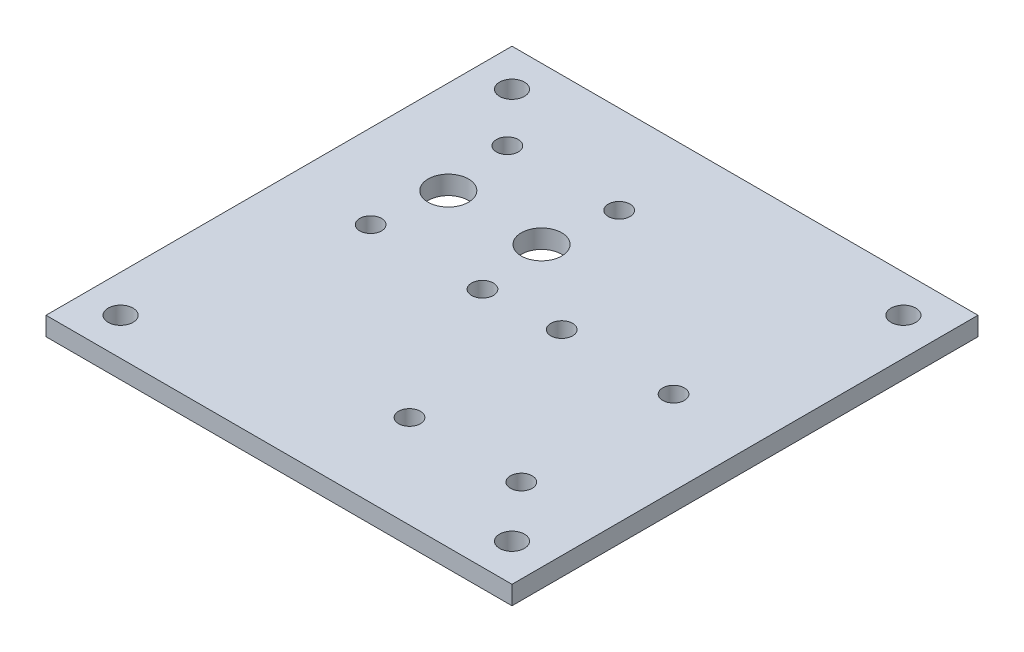
ISO-10303-21;
HEADER;
FILE_DESCRIPTION(('STEP AP214'),'2;1');
FILE_NAME('part.step','',(''),(''),'','','');
FILE_SCHEMA(('AUTOMOTIVE_DESIGN { 1 0 10303 214 1 1 1 1 }'));
ENDSEC;
DATA;
#1=APPLICATION_CONTEXT('core data for automotive mechanical design processes');
#2=APPLICATION_PROTOCOL_DEFINITION('international standard','automotive_design',2000,#1);
#3=PRODUCT_CONTEXT('',#1,'mechanical');
#4=PRODUCT('Part','Part','',(#3));
#5=PRODUCT_RELATED_PRODUCT_CATEGORY('part','',(#4));
#6=PRODUCT_DEFINITION_FORMATION('','',#4);
#7=PRODUCT_DEFINITION_CONTEXT('part definition',#1,'design');
#8=PRODUCT_DEFINITION('design','',#6,#7);
#9=PRODUCT_DEFINITION_SHAPE('','',#8);
#10=(LENGTH_UNIT() NAMED_UNIT(*) SI_UNIT(.MILLI.,.METRE.));
#11=(NAMED_UNIT(*) PLANE_ANGLE_UNIT() SI_UNIT($,.RADIAN.));
#12=(NAMED_UNIT(*) SI_UNIT($,.STERADIAN.) SOLID_ANGLE_UNIT());
#13=UNCERTAINTY_MEASURE_WITH_UNIT(LENGTH_MEASURE(1.E-05),#10,'distance_accuracy_value','');
#14=(GEOMETRIC_REPRESENTATION_CONTEXT(3) GLOBAL_UNCERTAINTY_ASSIGNED_CONTEXT((#13)) GLOBAL_UNIT_ASSIGNED_CONTEXT((#10,
#11,#12)) REPRESENTATION_CONTEXT('',''));
#15=CARTESIAN_POINT('',(0.,0.,0.));
#16=DIRECTION('',(0.,0.,1.));
#17=DIRECTION('',(1.,0.,0.));
#18=AXIS2_PLACEMENT_3D('',#15,#16,#17);
#19=CARTESIAN_POINT('',(0.,3.,0.));
#20=DIRECTION('',(0.,-1.,0.));
#21=DIRECTION('',(0.,0.,-1.));
#22=AXIS2_PLACEMENT_3D('',#19,#20,#21);
#23=PLANE('',#22);
#24=DIRECTION('',(0.,0.,-1.));
#25=VECTOR('',#24,1.);
#26=CARTESIAN_POINT('',(37.5,3.,37.5));
#27=LINE('',#26,#25);
#28=CARTESIAN_POINT('',(37.5,3.,37.5));
#29=VERTEX_POINT('',#28);
#30=CARTESIAN_POINT('',(37.5,3.,-37.5));
#31=VERTEX_POINT('',#30);
#32=EDGE_CURVE('E85',#29,#31,#27,.T.);
#33=ORIENTED_EDGE('',*,*,#32,.T.);
#34=DIRECTION('',(-1.,0.,0.));
#35=VECTOR('',#34,1.);
#36=CARTESIAN_POINT('',(-37.5,3.,-37.5));
#37=LINE('',#36,#35);
#38=CARTESIAN_POINT('',(-37.5,3.,-37.5));
#39=VERTEX_POINT('',#38);
#40=EDGE_CURVE('E80',#31,#39,#37,.T.);
#41=ORIENTED_EDGE('',*,*,#40,.T.);
#42=DIRECTION('',(0.,0.,1.));
#43=VECTOR('',#42,1.);
#44=CARTESIAN_POINT('',(-37.5,3.,37.5));
#45=LINE('',#44,#43);
#46=CARTESIAN_POINT('',(-37.5,3.,37.5));
#47=VERTEX_POINT('',#46);
#48=EDGE_CURVE('E83',#39,#47,#45,.T.);
#49=ORIENTED_EDGE('',*,*,#48,.T.);
#50=DIRECTION('',(1.,0.,0.));
#51=VECTOR('',#50,1.);
#52=CARTESIAN_POINT('',(-37.5,3.,37.5));
#53=LINE('',#52,#51);
#54=EDGE_CURVE('E50',#47,#29,#53,.T.);
#55=ORIENTED_EDGE('',*,*,#54,.T.);
#56=EDGE_LOOP('',(#33,#41,#49,#55));
#57=FACE_BOUND('',#56,.T.);
#58=CARTESIAN_POINT('',(31.5,3.,-31.5));
#59=DIRECTION('',(0.,1.,0.));
#60=DIRECTION('',(0.,0.,1.));
#61=AXIS2_PLACEMENT_3D('',#58,#59,#60);
#62=CIRCLE('',#61,2.);
#63=CARTESIAN_POINT('',(31.5,3.,-29.5));
#64=VERTEX_POINT('',#63);
#65=EDGE_CURVE('E100',#64,#64,#62,.T.);
#66=ORIENTED_EDGE('',*,*,#65,.F.);
#67=EDGE_LOOP('',(#66));
#68=FACE_BOUND('',#67,.T.);
#69=CARTESIAN_POINT('',(-22.5,3.,-12.2499999999998));
#70=DIRECTION('',(0.,1.,0.));
#71=DIRECTION('',(0.,0.,1.));
#72=AXIS2_PLACEMENT_3D('',#69,#70,#71);
#73=CIRCLE('',#72,3.25);
#74=CARTESIAN_POINT('',(-22.5,3.,-8.99999999999979));
#75=VERTEX_POINT('',#74);
#76=EDGE_CURVE('E115',#75,#75,#73,.T.);
#77=ORIENTED_EDGE('',*,*,#76,.F.);
#78=EDGE_LOOP('',(#77));
#79=FACE_BOUND('',#78,.T.);
#80=CARTESIAN_POINT('',(31.5,3.,31.5));
#81=DIRECTION('',(0.,1.,0.));
#82=DIRECTION('',(0.,0.,1.));
#83=AXIS2_PLACEMENT_3D('',#80,#81,#82);
#84=CIRCLE('',#83,2.00000000000001);
#85=CARTESIAN_POINT('',(31.5,3.,33.5));
#86=VERTEX_POINT('',#85);
#87=EDGE_CURVE('E121',#86,#86,#84,.T.);
#88=ORIENTED_EDGE('',*,*,#87,.F.);
#89=EDGE_LOOP('',(#88));
#90=FACE_BOUND('',#89,.T.);
#91=CARTESIAN_POINT('',(-31.5,3.,31.5));
#92=DIRECTION('',(0.,1.,0.));
#93=DIRECTION('',(0.,0.,1.));
#94=AXIS2_PLACEMENT_3D('',#91,#92,#93);
#95=CIRCLE('',#94,2.00000000000001);
#96=CARTESIAN_POINT('',(-31.5,3.,33.5));
#97=VERTEX_POINT('',#96);
#98=EDGE_CURVE('E127',#97,#97,#95,.T.);
#99=ORIENTED_EDGE('',*,*,#98,.F.);
#100=EDGE_LOOP('',(#99));
#101=FACE_BOUND('',#100,.T.);
#102=CARTESIAN_POINT('',(-31.5,3.,-31.5));
#103=DIRECTION('',(0.,1.,0.));
#104=DIRECTION('',(0.,0.,1.));
#105=AXIS2_PLACEMENT_3D('',#102,#103,#104);
#106=CIRCLE('',#105,2.00000000000001);
#107=CARTESIAN_POINT('',(-31.5,3.,-29.5));
#108=VERTEX_POINT('',#107);
#109=EDGE_CURVE('E133',#108,#108,#106,.T.);
#110=ORIENTED_EDGE('',*,*,#109,.F.);
#111=EDGE_LOOP('',(#110));
#112=FACE_BOUND('',#111,.T.);
#113=CARTESIAN_POINT('',(-7.5,3.,-12.2499999999998));
#114=DIRECTION('',(0.,1.,0.));
#115=DIRECTION('',(0.,0.,1.));
#116=AXIS2_PLACEMENT_3D('',#113,#114,#115);
#117=CIRCLE('',#116,3.25);
#118=CARTESIAN_POINT('',(-7.5,3.,-8.99999999999979));
#119=VERTEX_POINT('',#118);
#120=EDGE_CURVE('E139',#119,#119,#117,.T.);
#121=ORIENTED_EDGE('',*,*,#120,.F.);
#122=EDGE_LOOP('',(#121));
#123=FACE_BOUND('',#122,.T.);
#124=CARTESIAN_POINT('',(-24.,3.,-23.2499999999998));
#125=DIRECTION('',(0.,1.,0.));
#126=DIRECTION('',(0.,0.,1.));
#127=AXIS2_PLACEMENT_3D('',#124,#125,#126);
#128=CIRCLE('',#127,1.75);
#129=CARTESIAN_POINT('',(-24.,3.,-21.4999999999998));
#130=VERTEX_POINT('',#129);
#131=EDGE_CURVE('E145',#130,#130,#128,.T.);
#132=ORIENTED_EDGE('',*,*,#131,.F.);
#133=EDGE_LOOP('',(#132));
#134=FACE_BOUND('',#133,.T.);
#135=CARTESIAN_POINT('',(-5.99999999999997,3.,-23.2499999999998));
#136=DIRECTION('',(0.,1.,0.));
#137=DIRECTION('',(0.,0.,1.));
#138=AXIS2_PLACEMENT_3D('',#135,#136,#137);
#139=CIRCLE('',#138,1.75);
#140=CARTESIAN_POINT('',(-5.99999999999997,3.,-21.4999999999998));
#141=VERTEX_POINT('',#140);
#142=EDGE_CURVE('E151',#141,#141,#139,.T.);
#143=ORIENTED_EDGE('',*,*,#142,.F.);
#144=EDGE_LOOP('',(#143));
#145=FACE_BOUND('',#144,.T.);
#146=CARTESIAN_POINT('',(-24.,3.,-1.25000000000033));
#147=DIRECTION('',(0.,1.,0.));
#148=DIRECTION('',(0.,0.,1.));
#149=AXIS2_PLACEMENT_3D('',#146,#147,#148);
#150=CIRCLE('',#149,1.75);
#151=CARTESIAN_POINT('',(-24.,3.,0.499999999999669));
#152=VERTEX_POINT('',#151);
#153=EDGE_CURVE('E157',#152,#152,#150,.T.);
#154=ORIENTED_EDGE('',*,*,#153,.F.);
#155=EDGE_LOOP('',(#154));
#156=FACE_BOUND('',#155,.T.);
#157=CARTESIAN_POINT('',(-5.99999999999997,3.,-1.25000000000033));
#158=DIRECTION('',(0.,1.,0.));
#159=DIRECTION('',(0.,0.,1.));
#160=AXIS2_PLACEMENT_3D('',#157,#158,#159);
#161=CIRCLE('',#160,1.75);
#162=CARTESIAN_POINT('',(-5.99999999999997,3.,0.49999999999967));
#163=VERTEX_POINT('',#162);
#164=EDGE_CURVE('E163',#163,#163,#161,.T.);
#165=ORIENTED_EDGE('',*,*,#164,.F.);
#166=EDGE_LOOP('',(#165));
#167=FACE_BOUND('',#166,.T.);
#168=CARTESIAN_POINT('',(6.00000000000003,3.,22.5000000000001));
#169=DIRECTION('',(0.,1.,0.));
#170=DIRECTION('',(0.,0.,1.));
#171=AXIS2_PLACEMENT_3D('',#168,#169,#170);
#172=CIRCLE('',#171,1.75);
#173=CARTESIAN_POINT('',(6.00000000000003,3.,24.2500000000001));
#174=VERTEX_POINT('',#173);
#175=EDGE_CURVE('E169',#174,#174,#172,.T.);
#176=ORIENTED_EDGE('',*,*,#175,.F.);
#177=EDGE_LOOP('',(#176));
#178=FACE_BOUND('',#177,.T.);
#179=CARTESIAN_POINT('',(24.,3.,22.5000000000001));
#180=DIRECTION('',(0.,1.,0.));
#181=DIRECTION('',(0.,0.,1.));
#182=AXIS2_PLACEMENT_3D('',#179,#180,#181);
#183=CIRCLE('',#182,1.75);
#184=CARTESIAN_POINT('',(24.,3.,24.2500000000001));
#185=VERTEX_POINT('',#184);
#186=EDGE_CURVE('E175',#185,#185,#183,.T.);
#187=ORIENTED_EDGE('',*,*,#186,.F.);
#188=EDGE_LOOP('',(#187));
#189=FACE_BOUND('',#188,.T.);
#190=CARTESIAN_POINT('',(24.,3.,-1.99999999999995));
#191=DIRECTION('',(0.,1.,0.));
#192=DIRECTION('',(0.,0.,1.));
#193=AXIS2_PLACEMENT_3D('',#190,#191,#192);
#194=CIRCLE('',#193,1.75);
#195=CARTESIAN_POINT('',(24.,3.,-0.249999999999946));
#196=VERTEX_POINT('',#195);
#197=EDGE_CURVE('E181',#196,#196,#194,.T.);
#198=ORIENTED_EDGE('',*,*,#197,.F.);
#199=EDGE_LOOP('',(#198));
#200=FACE_BOUND('',#199,.T.);
#201=CARTESIAN_POINT('',(6.00000000000003,3.,-1.99999999999994));
#202=DIRECTION('',(0.,1.,0.));
#203=DIRECTION('',(0.,0.,1.));
#204=AXIS2_PLACEMENT_3D('',#201,#202,#203);
#205=CIRCLE('',#204,1.75);
#206=CARTESIAN_POINT('',(6.00000000000003,3.,-0.249999999999936));
#207=VERTEX_POINT('',#206);
#208=EDGE_CURVE('E187',#207,#207,#205,.T.);
#209=ORIENTED_EDGE('',*,*,#208,.F.);
#210=EDGE_LOOP('',(#209));
#211=FACE_BOUND('',#210,.T.);
#212=ADVANCED_FACE('F33',(#57,#68,#79,#90,#101,#112,#123,#134,#145,#156,#167,#178,#189,#200,
#211),#23,.F.);
#213=CARTESIAN_POINT('',(0.,0.,0.));
#214=DIRECTION('',(0.,-1.,0.));
#215=DIRECTION('',(0.,0.,-1.));
#216=AXIS2_PLACEMENT_3D('',#213,#214,#215);
#217=PLANE('',#216);
#218=CARTESIAN_POINT('',(24.,0.,-1.99999999999995));
#219=DIRECTION('',(0.,1.,0.));
#220=DIRECTION('',(0.,0.,1.));
#221=AXIS2_PLACEMENT_3D('',#218,#219,#220);
#222=CIRCLE('',#221,1.75);
#223=CARTESIAN_POINT('',(24.,0.,-0.249999999999946));
#224=VERTEX_POINT('',#223);
#225=EDGE_CURVE('E184',#224,#224,#222,.T.);
#226=ORIENTED_EDGE('',*,*,#225,.T.);
#227=EDGE_LOOP('',(#226));
#228=FACE_BOUND('',#227,.T.);
#229=CARTESIAN_POINT('',(6.00000000000003,0.,22.5000000000001));
#230=DIRECTION('',(0.,1.,0.));
#231=DIRECTION('',(0.,0.,1.));
#232=AXIS2_PLACEMENT_3D('',#229,#230,#231);
#233=CIRCLE('',#232,1.75);
#234=CARTESIAN_POINT('',(6.00000000000003,0.,24.2500000000001));
#235=VERTEX_POINT('',#234);
#236=EDGE_CURVE('E172',#235,#235,#233,.T.);
#237=ORIENTED_EDGE('',*,*,#236,.T.);
#238=EDGE_LOOP('',(#237));
#239=FACE_BOUND('',#238,.T.);
#240=CARTESIAN_POINT('',(-24.,0.,-1.25000000000033));
#241=DIRECTION('',(0.,1.,0.));
#242=DIRECTION('',(0.,0.,1.));
#243=AXIS2_PLACEMENT_3D('',#240,#241,#242);
#244=CIRCLE('',#243,1.75);
#245=CARTESIAN_POINT('',(-24.,0.,0.499999999999669));
#246=VERTEX_POINT('',#245);
#247=EDGE_CURVE('E160',#246,#246,#244,.T.);
#248=ORIENTED_EDGE('',*,*,#247,.T.);
#249=EDGE_LOOP('',(#248));
#250=FACE_BOUND('',#249,.T.);
#251=CARTESIAN_POINT('',(-24.,0.,-23.2499999999998));
#252=DIRECTION('',(0.,1.,0.));
#253=DIRECTION('',(0.,0.,1.));
#254=AXIS2_PLACEMENT_3D('',#251,#252,#253);
#255=CIRCLE('',#254,1.75);
#256=CARTESIAN_POINT('',(-24.,0.,-21.4999999999998));
#257=VERTEX_POINT('',#256);
#258=EDGE_CURVE('E148',#257,#257,#255,.T.);
#259=ORIENTED_EDGE('',*,*,#258,.T.);
#260=EDGE_LOOP('',(#259));
#261=FACE_BOUND('',#260,.T.);
#262=CARTESIAN_POINT('',(-31.5,0.,-31.5));
#263=DIRECTION('',(0.,1.,0.));
#264=DIRECTION('',(0.,0.,1.));
#265=AXIS2_PLACEMENT_3D('',#262,#263,#264);
#266=CIRCLE('',#265,2.00000000000001);
#267=CARTESIAN_POINT('',(-31.5,0.,-29.5));
#268=VERTEX_POINT('',#267);
#269=EDGE_CURVE('E136',#268,#268,#266,.T.);
#270=ORIENTED_EDGE('',*,*,#269,.T.);
#271=EDGE_LOOP('',(#270));
#272=FACE_BOUND('',#271,.T.);
#273=CARTESIAN_POINT('',(31.5,0.,31.5));
#274=DIRECTION('',(0.,1.,0.));
#275=DIRECTION('',(0.,0.,1.));
#276=AXIS2_PLACEMENT_3D('',#273,#274,#275);
#277=CIRCLE('',#276,2.00000000000001);
#278=CARTESIAN_POINT('',(31.5,0.,33.5));
#279=VERTEX_POINT('',#278);
#280=EDGE_CURVE('E124',#279,#279,#277,.T.);
#281=ORIENTED_EDGE('',*,*,#280,.T.);
#282=EDGE_LOOP('',(#281));
#283=FACE_BOUND('',#282,.T.);
#284=CARTESIAN_POINT('',(31.5,0.,-31.5));
#285=DIRECTION('',(0.,1.,0.));
#286=DIRECTION('',(0.,0.,1.));
#287=AXIS2_PLACEMENT_3D('',#284,#285,#286);
#288=CIRCLE('',#287,2.);
#289=CARTESIAN_POINT('',(31.5,0.,-29.5));
#290=VERTEX_POINT('',#289);
#291=EDGE_CURVE('E112',#290,#290,#288,.T.);
#292=ORIENTED_EDGE('',*,*,#291,.T.);
#293=EDGE_LOOP('',(#292));
#294=FACE_BOUND('',#293,.T.);
#295=DIRECTION('',(0.,0.,-1.));
#296=VECTOR('',#295,1.);
#297=CARTESIAN_POINT('',(37.5,0.,37.5));
#298=LINE('',#297,#296);
#299=CARTESIAN_POINT('',(37.5,0.,37.5));
#300=VERTEX_POINT('',#299);
#301=CARTESIAN_POINT('',(37.5,0.,-37.5));
#302=VERTEX_POINT('',#301);
#303=EDGE_CURVE('E97',#300,#302,#298,.T.);
#304=ORIENTED_EDGE('',*,*,#303,.F.);
#305=DIRECTION('',(1.,0.,0.));
#306=VECTOR('',#305,1.);
#307=CARTESIAN_POINT('',(-37.5,0.,37.5));
#308=LINE('',#307,#306);
#309=CARTESIAN_POINT('',(-37.5,0.,37.5));
#310=VERTEX_POINT('',#309);
#311=EDGE_CURVE('E73',#310,#300,#308,.T.);
#312=ORIENTED_EDGE('',*,*,#311,.F.);
#313=DIRECTION('',(0.,0.,1.));
#314=VECTOR('',#313,1.);
#315=CARTESIAN_POINT('',(-37.5,0.,37.5));
#316=LINE('',#315,#314);
#317=CARTESIAN_POINT('',(-37.5,0.,-37.5));
#318=VERTEX_POINT('',#317);
#319=EDGE_CURVE('E67',#318,#310,#316,.T.);
#320=ORIENTED_EDGE('',*,*,#319,.F.);
#321=DIRECTION('',(-1.,0.,0.));
#322=VECTOR('',#321,1.);
#323=CARTESIAN_POINT('',(-37.5,0.,-37.5));
#324=LINE('',#323,#322);
#325=EDGE_CURVE('E89',#302,#318,#324,.T.);
#326=ORIENTED_EDGE('',*,*,#325,.F.);
#327=EDGE_LOOP('',(#304,#312,#320,#326));
#328=FACE_BOUND('',#327,.T.);
#329=CARTESIAN_POINT('',(-22.5,0.,-12.2499999999998));
#330=DIRECTION('',(0.,1.,0.));
#331=DIRECTION('',(0.,0.,1.));
#332=AXIS2_PLACEMENT_3D('',#329,#330,#331);
#333=CIRCLE('',#332,3.25);
#334=CARTESIAN_POINT('',(-22.5,0.,-8.99999999999979));
#335=VERTEX_POINT('',#334);
#336=EDGE_CURVE('E118',#335,#335,#333,.T.);
#337=ORIENTED_EDGE('',*,*,#336,.T.);
#338=EDGE_LOOP('',(#337));
#339=FACE_BOUND('',#338,.T.);
#340=CARTESIAN_POINT('',(-31.5,0.,31.5));
#341=DIRECTION('',(0.,1.,0.));
#342=DIRECTION('',(0.,0.,1.));
#343=AXIS2_PLACEMENT_3D('',#340,#341,#342);
#344=CIRCLE('',#343,2.00000000000001);
#345=CARTESIAN_POINT('',(-31.5,0.,33.5));
#346=VERTEX_POINT('',#345);
#347=EDGE_CURVE('E130',#346,#346,#344,.T.);
#348=ORIENTED_EDGE('',*,*,#347,.T.);
#349=EDGE_LOOP('',(#348));
#350=FACE_BOUND('',#349,.T.);
#351=CARTESIAN_POINT('',(-7.5,0.,-12.2499999999998));
#352=DIRECTION('',(0.,1.,0.));
#353=DIRECTION('',(0.,0.,1.));
#354=AXIS2_PLACEMENT_3D('',#351,#352,#353);
#355=CIRCLE('',#354,3.25);
#356=CARTESIAN_POINT('',(-7.5,0.,-8.99999999999979));
#357=VERTEX_POINT('',#356);
#358=EDGE_CURVE('E142',#357,#357,#355,.T.);
#359=ORIENTED_EDGE('',*,*,#358,.T.);
#360=EDGE_LOOP('',(#359));
#361=FACE_BOUND('',#360,.T.);
#362=CARTESIAN_POINT('',(-5.99999999999997,0.,-23.2499999999998));
#363=DIRECTION('',(0.,1.,0.));
#364=DIRECTION('',(0.,0.,1.));
#365=AXIS2_PLACEMENT_3D('',#362,#363,#364);
#366=CIRCLE('',#365,1.75);
#367=CARTESIAN_POINT('',(-5.99999999999997,0.,-21.4999999999998));
#368=VERTEX_POINT('',#367);
#369=EDGE_CURVE('E154',#368,#368,#366,.T.);
#370=ORIENTED_EDGE('',*,*,#369,.T.);
#371=EDGE_LOOP('',(#370));
#372=FACE_BOUND('',#371,.T.);
#373=CARTESIAN_POINT('',(-5.99999999999997,0.,-1.25000000000033));
#374=DIRECTION('',(0.,1.,0.));
#375=DIRECTION('',(0.,0.,1.));
#376=AXIS2_PLACEMENT_3D('',#373,#374,#375);
#377=CIRCLE('',#376,1.75);
#378=CARTESIAN_POINT('',(-5.99999999999997,0.,0.49999999999967));
#379=VERTEX_POINT('',#378);
#380=EDGE_CURVE('E166',#379,#379,#377,.T.);
#381=ORIENTED_EDGE('',*,*,#380,.T.);
#382=EDGE_LOOP('',(#381));
#383=FACE_BOUND('',#382,.T.);
#384=CARTESIAN_POINT('',(24.,0.,22.5000000000001));
#385=DIRECTION('',(0.,1.,0.));
#386=DIRECTION('',(0.,0.,1.));
#387=AXIS2_PLACEMENT_3D('',#384,#385,#386);
#388=CIRCLE('',#387,1.75);
#389=CARTESIAN_POINT('',(24.,0.,24.2500000000001));
#390=VERTEX_POINT('',#389);
#391=EDGE_CURVE('E178',#390,#390,#388,.T.);
#392=ORIENTED_EDGE('',*,*,#391,.T.);
#393=EDGE_LOOP('',(#392));
#394=FACE_BOUND('',#393,.T.);
#395=CARTESIAN_POINT('',(6.00000000000003,0.,-1.99999999999994));
#396=DIRECTION('',(0.,1.,0.));
#397=DIRECTION('',(0.,0.,1.));
#398=AXIS2_PLACEMENT_3D('',#395,#396,#397);
#399=CIRCLE('',#398,1.75);
#400=CARTESIAN_POINT('',(6.00000000000003,0.,-0.249999999999936));
#401=VERTEX_POINT('',#400);
#402=EDGE_CURVE('E190',#401,#401,#399,.T.);
#403=ORIENTED_EDGE('',*,*,#402,.T.);
#404=EDGE_LOOP('',(#403));
#405=FACE_BOUND('',#404,.T.);
#406=ADVANCED_FACE('F108',(#228,#239,#250,#261,#272,#283,#294,#328,#339,#350,#361,#372,#383,
#394,#405),#217,.T.);
#407=CARTESIAN_POINT('',(37.5,3.,37.5));
#408=DIRECTION('',(-1.,0.,0.));
#409=DIRECTION('',(0.,0.,1.));
#410=AXIS2_PLACEMENT_3D('',#407,#408,#409);
#411=PLANE('',#410);
#412=ORIENTED_EDGE('',*,*,#303,.T.);
#413=DIRECTION('',(0.,-1.,0.));
#414=VECTOR('',#413,1.);
#415=CARTESIAN_POINT('',(37.5,3.,-37.5));
#416=LINE('',#415,#414);
#417=EDGE_CURVE('E11',#31,#302,#416,.T.);
#418=ORIENTED_EDGE('',*,*,#417,.F.);
#419=ORIENTED_EDGE('',*,*,#32,.F.);
#420=DIRECTION('',(0.,-1.,0.));
#421=VECTOR('',#420,1.);
#422=CARTESIAN_POINT('',(37.5,3.,37.5));
#423=LINE('',#422,#421);
#424=EDGE_CURVE('E93',#29,#300,#423,.T.);
#425=ORIENTED_EDGE('',*,*,#424,.T.);
#426=EDGE_LOOP('',(#412,#418,#419,#425));
#427=FACE_BOUND('',#426,.T.);
#428=ADVANCED_FACE('F35',(#427),#411,.F.);
#429=CARTESIAN_POINT('',(-37.5,3.,-37.5));
#430=DIRECTION('',(0.,0.,1.));
#431=DIRECTION('',(1.,0.,0.));
#432=AXIS2_PLACEMENT_3D('',#429,#430,#431);
#433=PLANE('',#432);
#434=ORIENTED_EDGE('',*,*,#325,.T.);
#435=DIRECTION('',(0.,-1.,0.));
#436=VECTOR('',#435,1.);
#437=CARTESIAN_POINT('',(-37.5,3.,-37.5));
#438=LINE('',#437,#436);
#439=EDGE_CURVE('E42',#39,#318,#438,.T.);
#440=ORIENTED_EDGE('',*,*,#439,.F.);
#441=ORIENTED_EDGE('',*,*,#40,.F.);
#442=ORIENTED_EDGE('',*,*,#417,.T.);
#443=EDGE_LOOP('',(#434,#440,#441,#442));
#444=FACE_BOUND('',#443,.T.);
#445=ADVANCED_FACE('F88',(#444),#433,.F.);
#446=CARTESIAN_POINT('',(-37.5,3.,37.5));
#447=DIRECTION('',(1.,0.,0.));
#448=DIRECTION('',(0.,0.,-1.));
#449=AXIS2_PLACEMENT_3D('',#446,#447,#448);
#450=PLANE('',#449);
#451=ORIENTED_EDGE('',*,*,#319,.T.);
#452=DIRECTION('',(0.,-1.,0.));
#453=VECTOR('',#452,1.);
#454=CARTESIAN_POINT('',(-37.5,3.,37.5));
#455=LINE('',#454,#453);
#456=EDGE_CURVE('E90',#47,#310,#455,.T.);
#457=ORIENTED_EDGE('',*,*,#456,.F.);
#458=ORIENTED_EDGE('',*,*,#48,.F.);
#459=ORIENTED_EDGE('',*,*,#439,.T.);
#460=EDGE_LOOP('',(#451,#457,#458,#459));
#461=FACE_BOUND('',#460,.T.);
#462=ADVANCED_FACE('F91',(#461),#450,.F.);
#463=CARTESIAN_POINT('',(-37.5,3.,37.5));
#464=DIRECTION('',(0.,0.,-1.));
#465=DIRECTION('',(-1.,0.,0.));
#466=AXIS2_PLACEMENT_3D('',#463,#464,#465);
#467=PLANE('',#466);
#468=ORIENTED_EDGE('',*,*,#311,.T.);
#469=ORIENTED_EDGE('',*,*,#424,.F.);
#470=ORIENTED_EDGE('',*,*,#54,.F.);
#471=ORIENTED_EDGE('',*,*,#456,.T.);
#472=EDGE_LOOP('',(#468,#469,#470,#471));
#473=FACE_BOUND('',#472,.T.);
#474=ADVANCED_FACE('F105',(#473),#467,.F.);
#475=CARTESIAN_POINT('',(31.5,3.,-31.5));
#476=DIRECTION('',(0.,-1.,0.));
#477=DIRECTION('',(0.,0.,-1.));
#478=AXIS2_PLACEMENT_3D('',#475,#476,#477);
#479=CYLINDRICAL_SURFACE('',#478,2.);
#480=ORIENTED_EDGE('',*,*,#65,.T.);
#481=EDGE_LOOP('',(#480));
#482=FACE_BOUND('',#481,.T.);
#483=ORIENTED_EDGE('',*,*,#291,.F.);
#484=EDGE_LOOP('',(#483));
#485=FACE_BOUND('',#484,.T.);
#486=ADVANCED_FACE('F207',(#482,#485),#479,.F.);
#487=CARTESIAN_POINT('',(-22.5,3.,-12.2499999999998));
#488=DIRECTION('',(0.,-1.,0.));
#489=DIRECTION('',(0.,0.,-1.));
#490=AXIS2_PLACEMENT_3D('',#487,#488,#489);
#491=CYLINDRICAL_SURFACE('',#490,3.25);
#492=ORIENTED_EDGE('',*,*,#76,.T.);
#493=EDGE_LOOP('',(#492));
#494=FACE_BOUND('',#493,.T.);
#495=ORIENTED_EDGE('',*,*,#336,.F.);
#496=EDGE_LOOP('',(#495));
#497=FACE_BOUND('',#496,.T.);
#498=ADVANCED_FACE('F253',(#494,#497),#491,.F.);
#499=CARTESIAN_POINT('',(31.5,3.,31.5));
#500=DIRECTION('',(0.,-1.,0.));
#501=DIRECTION('',(0.,0.,-1.));
#502=AXIS2_PLACEMENT_3D('',#499,#500,#501);
#503=CYLINDRICAL_SURFACE('',#502,2.00000000000001);
#504=ORIENTED_EDGE('',*,*,#87,.T.);
#505=EDGE_LOOP('',(#504));
#506=FACE_BOUND('',#505,.T.);
#507=ORIENTED_EDGE('',*,*,#280,.F.);
#508=EDGE_LOOP('',(#507));
#509=FACE_BOUND('',#508,.T.);
#510=ADVANCED_FACE('F261',(#506,#509),#503,.F.);
#511=CARTESIAN_POINT('',(-31.5,3.,31.5));
#512=DIRECTION('',(0.,-1.,0.));
#513=DIRECTION('',(0.,0.,-1.));
#514=AXIS2_PLACEMENT_3D('',#511,#512,#513);
#515=CYLINDRICAL_SURFACE('',#514,2.00000000000001);
#516=ORIENTED_EDGE('',*,*,#98,.T.);
#517=EDGE_LOOP('',(#516));
#518=FACE_BOUND('',#517,.T.);
#519=ORIENTED_EDGE('',*,*,#347,.F.);
#520=EDGE_LOOP('',(#519));
#521=FACE_BOUND('',#520,.T.);
#522=ADVANCED_FACE('F269',(#518,#521),#515,.F.);
#523=CARTESIAN_POINT('',(-31.5,3.,-31.5));
#524=DIRECTION('',(0.,-1.,0.));
#525=DIRECTION('',(0.,0.,-1.));
#526=AXIS2_PLACEMENT_3D('',#523,#524,#525);
#527=CYLINDRICAL_SURFACE('',#526,2.00000000000001);
#528=ORIENTED_EDGE('',*,*,#109,.T.);
#529=EDGE_LOOP('',(#528));
#530=FACE_BOUND('',#529,.T.);
#531=ORIENTED_EDGE('',*,*,#269,.F.);
#532=EDGE_LOOP('',(#531));
#533=FACE_BOUND('',#532,.T.);
#534=ADVANCED_FACE('F278',(#530,#533),#527,.F.);
#535=CARTESIAN_POINT('',(-7.5,3.,-12.2499999999998));
#536=DIRECTION('',(0.,-1.,0.));
#537=DIRECTION('',(0.,0.,-1.));
#538=AXIS2_PLACEMENT_3D('',#535,#536,#537);
#539=CYLINDRICAL_SURFACE('',#538,3.25);
#540=ORIENTED_EDGE('',*,*,#120,.T.);
#541=EDGE_LOOP('',(#540));
#542=FACE_BOUND('',#541,.T.);
#543=ORIENTED_EDGE('',*,*,#358,.F.);
#544=EDGE_LOOP('',(#543));
#545=FACE_BOUND('',#544,.T.);
#546=ADVANCED_FACE('F287',(#542,#545),#539,.F.);
#547=CARTESIAN_POINT('',(-24.,3.,-23.2499999999998));
#548=DIRECTION('',(0.,-1.,0.));
#549=DIRECTION('',(0.,0.,-1.));
#550=AXIS2_PLACEMENT_3D('',#547,#548,#549);
#551=CYLINDRICAL_SURFACE('',#550,1.75);
#552=ORIENTED_EDGE('',*,*,#131,.T.);
#553=EDGE_LOOP('',(#552));
#554=FACE_BOUND('',#553,.T.);
#555=ORIENTED_EDGE('',*,*,#258,.F.);
#556=EDGE_LOOP('',(#555));
#557=FACE_BOUND('',#556,.T.);
#558=ADVANCED_FACE('F296',(#554,#557),#551,.F.);
#559=CARTESIAN_POINT('',(-5.99999999999997,3.,-23.2499999999998));
#560=DIRECTION('',(0.,-1.,0.));
#561=DIRECTION('',(0.,0.,-1.));
#562=AXIS2_PLACEMENT_3D('',#559,#560,#561);
#563=CYLINDRICAL_SURFACE('',#562,1.75);
#564=ORIENTED_EDGE('',*,*,#142,.T.);
#565=EDGE_LOOP('',(#564));
#566=FACE_BOUND('',#565,.T.);
#567=ORIENTED_EDGE('',*,*,#369,.F.);
#568=EDGE_LOOP('',(#567));
#569=FACE_BOUND('',#568,.T.);
#570=ADVANCED_FACE('F305',(#566,#569),#563,.F.);
#571=CARTESIAN_POINT('',(-24.,3.,-1.25000000000033));
#572=DIRECTION('',(0.,-1.,0.));
#573=DIRECTION('',(0.,0.,-1.));
#574=AXIS2_PLACEMENT_3D('',#571,#572,#573);
#575=CYLINDRICAL_SURFACE('',#574,1.75);
#576=ORIENTED_EDGE('',*,*,#153,.T.);
#577=EDGE_LOOP('',(#576));
#578=FACE_BOUND('',#577,.T.);
#579=ORIENTED_EDGE('',*,*,#247,.F.);
#580=EDGE_LOOP('',(#579));
#581=FACE_BOUND('',#580,.T.);
#582=ADVANCED_FACE('F314',(#578,#581),#575,.F.);
#583=CARTESIAN_POINT('',(-5.99999999999997,3.,-1.25000000000033));
#584=DIRECTION('',(0.,-1.,0.));
#585=DIRECTION('',(0.,0.,-1.));
#586=AXIS2_PLACEMENT_3D('',#583,#584,#585);
#587=CYLINDRICAL_SURFACE('',#586,1.75);
#588=ORIENTED_EDGE('',*,*,#164,.T.);
#589=EDGE_LOOP('',(#588));
#590=FACE_BOUND('',#589,.T.);
#591=ORIENTED_EDGE('',*,*,#380,.F.);
#592=EDGE_LOOP('',(#591));
#593=FACE_BOUND('',#592,.T.);
#594=ADVANCED_FACE('F323',(#590,#593),#587,.F.);
#595=CARTESIAN_POINT('',(6.00000000000003,3.,22.5000000000001));
#596=DIRECTION('',(0.,-1.,0.));
#597=DIRECTION('',(0.,0.,-1.));
#598=AXIS2_PLACEMENT_3D('',#595,#596,#597);
#599=CYLINDRICAL_SURFACE('',#598,1.75);
#600=ORIENTED_EDGE('',*,*,#175,.T.);
#601=EDGE_LOOP('',(#600));
#602=FACE_BOUND('',#601,.T.);
#603=ORIENTED_EDGE('',*,*,#236,.F.);
#604=EDGE_LOOP('',(#603));
#605=FACE_BOUND('',#604,.T.);
#606=ADVANCED_FACE('F332',(#602,#605),#599,.F.);
#607=CARTESIAN_POINT('',(24.,3.,22.5000000000001));
#608=DIRECTION('',(0.,-1.,0.));
#609=DIRECTION('',(0.,0.,-1.));
#610=AXIS2_PLACEMENT_3D('',#607,#608,#609);
#611=CYLINDRICAL_SURFACE('',#610,1.75);
#612=ORIENTED_EDGE('',*,*,#186,.T.);
#613=EDGE_LOOP('',(#612));
#614=FACE_BOUND('',#613,.T.);
#615=ORIENTED_EDGE('',*,*,#391,.F.);
#616=EDGE_LOOP('',(#615));
#617=FACE_BOUND('',#616,.T.);
#618=ADVANCED_FACE('F341',(#614,#617),#611,.F.);
#619=CARTESIAN_POINT('',(24.,3.,-1.99999999999995));
#620=DIRECTION('',(0.,-1.,0.));
#621=DIRECTION('',(0.,0.,-1.));
#622=AXIS2_PLACEMENT_3D('',#619,#620,#621);
#623=CYLINDRICAL_SURFACE('',#622,1.75);
#624=ORIENTED_EDGE('',*,*,#197,.T.);
#625=EDGE_LOOP('',(#624));
#626=FACE_BOUND('',#625,.T.);
#627=ORIENTED_EDGE('',*,*,#225,.F.);
#628=EDGE_LOOP('',(#627));
#629=FACE_BOUND('',#628,.T.);
#630=ADVANCED_FACE('F350',(#626,#629),#623,.F.);
#631=CARTESIAN_POINT('',(6.00000000000003,3.,-1.99999999999994));
#632=DIRECTION('',(0.,-1.,0.));
#633=DIRECTION('',(0.,0.,-1.));
#634=AXIS2_PLACEMENT_3D('',#631,#632,#633);
#635=CYLINDRICAL_SURFACE('',#634,1.75);
#636=ORIENTED_EDGE('',*,*,#208,.T.);
#637=EDGE_LOOP('',(#636));
#638=FACE_BOUND('',#637,.T.);
#639=ORIENTED_EDGE('',*,*,#402,.F.);
#640=EDGE_LOOP('',(#639));
#641=FACE_BOUND('',#640,.T.);
#642=ADVANCED_FACE('F196',(#638,#641),#635,.F.);
#643=CLOSED_SHELL('',(#212,#406,#428,#445,#462,#474,#486,#498,#510,#522,#534,#546,#558,#570,
#582,#594,#606,#618,#630,#642));
#644=MANIFOLD_SOLID_BREP('B2',#643);
#645=ADVANCED_BREP_SHAPE_REPRESENTATION('',(#18,#644),#14);
#646=SHAPE_DEFINITION_REPRESENTATION(#9,#645);
ENDSEC;
END-ISO-10303-21;
